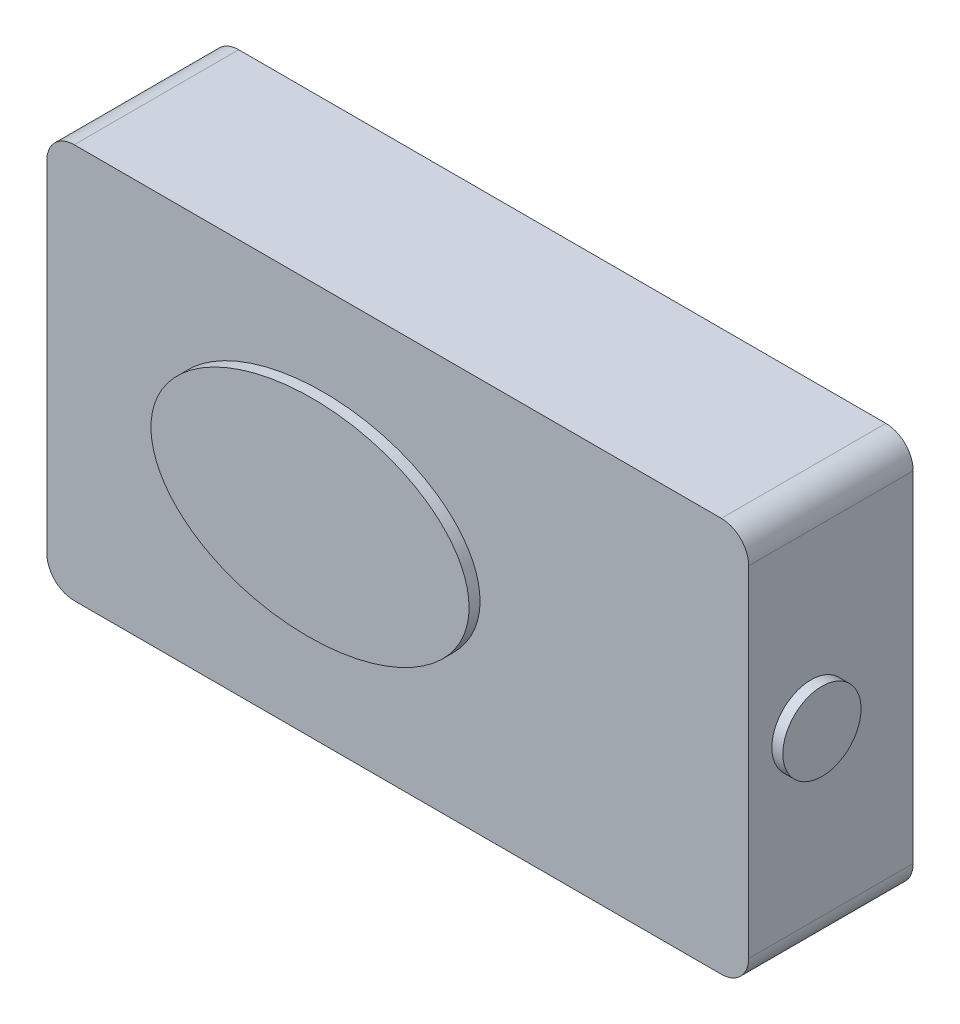
ISO-10303-21;
HEADER;
FILE_DESCRIPTION(('STEP AP214'),'2;1');
FILE_NAME('part.step','',(''),(''),'','','');
FILE_SCHEMA(('AUTOMOTIVE_DESIGN { 1 0 10303 214 1 1 1 1 }'));
ENDSEC;
DATA;
#1=APPLICATION_CONTEXT('core data for automotive mechanical design processes');
#2=APPLICATION_PROTOCOL_DEFINITION('international standard','automotive_design',2000,#1);
#3=PRODUCT_CONTEXT('',#1,'mechanical');
#4=PRODUCT('Part','Part','',(#3));
#5=PRODUCT_RELATED_PRODUCT_CATEGORY('part','',(#4));
#6=PRODUCT_DEFINITION_FORMATION('','',#4);
#7=PRODUCT_DEFINITION_CONTEXT('part definition',#1,'design');
#8=PRODUCT_DEFINITION('design','',#6,#7);
#9=PRODUCT_DEFINITION_SHAPE('','',#8);
#10=(LENGTH_UNIT() NAMED_UNIT(*) SI_UNIT(.MILLI.,.METRE.));
#11=(NAMED_UNIT(*) PLANE_ANGLE_UNIT() SI_UNIT($,.RADIAN.));
#12=(NAMED_UNIT(*) SI_UNIT($,.STERADIAN.) SOLID_ANGLE_UNIT());
#13=UNCERTAINTY_MEASURE_WITH_UNIT(LENGTH_MEASURE(1.E-05),#10,'distance_accuracy_value','');
#14=(GEOMETRIC_REPRESENTATION_CONTEXT(3) GLOBAL_UNCERTAINTY_ASSIGNED_CONTEXT((#13)) GLOBAL_UNIT_ASSIGNED_CONTEXT((#10,
#11,#12)) REPRESENTATION_CONTEXT('',''));
#15=CARTESIAN_POINT('',(0.,0.,0.));
#16=DIRECTION('',(0.,0.,1.));
#17=DIRECTION('',(1.,0.,0.));
#18=AXIS2_PLACEMENT_3D('',#15,#16,#17);
#19=CARTESIAN_POINT('',(34.3104693140794,17.9061371841155,15.));
#20=DIRECTION('',(-1.,0.,0.));
#21=DIRECTION('',(0.,0.,1.));
#22=AXIS2_PLACEMENT_3D('',#19,#20,#21);
#23=PLANE('',#22);
#24=DIRECTION('',(0.,1.,0.));
#25=VECTOR('',#24,1.);
#26=CARTESIAN_POINT('',(34.3104693140794,17.9061371841155,15.));
#27=LINE('',#26,#25);
#28=CARTESIAN_POINT('',(34.3104693140794,-15.5938628158845,15.));
#29=VERTEX_POINT('',#28);
#30=CARTESIAN_POINT('',(34.3104693140794,15.4061371841155,15.));
#31=VERTEX_POINT('',#30);
#32=EDGE_CURVE('E171',#29,#31,#27,.T.);
#33=ORIENTED_EDGE('',*,*,#32,.F.);
#34=DIRECTION('',(0.,0.,-1.));
#35=VECTOR('',#34,1.);
#36=CARTESIAN_POINT('',(34.3104693140794,-15.5938628158845,15.));
#37=LINE('',#36,#35);
#38=CARTESIAN_POINT('',(34.3104693140794,-15.5938628158845,0.));
#39=VERTEX_POINT('',#38);
#40=EDGE_CURVE('E155',#29,#39,#37,.T.);
#41=ORIENTED_EDGE('',*,*,#40,.T.);
#42=DIRECTION('',(0.,1.,0.));
#43=VECTOR('',#42,1.);
#44=CARTESIAN_POINT('',(34.3104693140794,17.9061371841155,0.));
#45=LINE('',#44,#43);
#46=CARTESIAN_POINT('',(34.3104693140794,15.4061371841155,0.));
#47=VERTEX_POINT('',#46);
#48=EDGE_CURVE('E125',#39,#47,#45,.T.);
#49=ORIENTED_EDGE('',*,*,#48,.T.);
#50=DIRECTION('',(0.,0.,-1.));
#51=VECTOR('',#50,1.);
#52=CARTESIAN_POINT('',(34.3104693140794,15.4061371841155,15.));
#53=LINE('',#52,#51);
#54=EDGE_CURVE('E153',#47,#31,#53,.F.);
#55=ORIENTED_EDGE('',*,*,#54,.T.);
#56=EDGE_LOOP('',(#33,#41,#49,#55));
#57=FACE_BOUND('',#56,.T.);
#58=CARTESIAN_POINT('',(34.3104693140794,0.,9.32507397833859));
#59=DIRECTION('',(-1.,0.,0.));
#60=DIRECTION('',(0.,0.,1.));
#61=AXIS2_PLACEMENT_3D('',#58,#59,#60);
#62=CIRCLE('',#61,3.56369619228473);
#63=CARTESIAN_POINT('',(34.3104693140794,0.,12.8887701706233));
#64=VERTEX_POINT('',#63);
#65=EDGE_CURVE('E11',#64,#64,#62,.F.);
#66=ORIENTED_EDGE('',*,*,#65,.F.);
#67=EDGE_LOOP('',(#66));
#68=FACE_BOUND('',#67,.T.);
#69=ADVANCED_FACE('F32',(#57,#68),#23,.F.);
#70=CARTESIAN_POINT('',(0.,0.,15.));
#71=DIRECTION('',(0.,0.,1.));
#72=DIRECTION('',(1.,0.,0.));
#73=AXIS2_PLACEMENT_3D('',#70,#71,#72);
#74=PLANE('',#73);
#75=DIRECTION('',(0.,-1.,0.));
#76=VECTOR('',#75,1.);
#77=CARTESIAN_POINT('',(-29.6895306859206,17.9061371841155,15.));
#78=LINE('',#77,#76);
#79=CARTESIAN_POINT('',(-29.6895306859206,15.4061371841155,15.));
#80=VERTEX_POINT('',#79);
#81=CARTESIAN_POINT('',(-29.6895306859206,-15.5938628158845,15.));
#82=VERTEX_POINT('',#81);
#83=EDGE_CURVE('E136',#80,#82,#78,.T.);
#84=ORIENTED_EDGE('',*,*,#83,.T.);
#85=CARTESIAN_POINT('',(-27.1895306859206,-15.5938628158845,15.));
#86=DIRECTION('',(0.,0.,1.));
#87=DIRECTION('',(1.,0.,0.));
#88=AXIS2_PLACEMENT_3D('',#85,#86,#87);
#89=CIRCLE('',#88,2.5);
#90=CARTESIAN_POINT('',(-27.1895306859206,-18.0938628158845,15.));
#91=VERTEX_POINT('',#90);
#92=EDGE_CURVE('E151',#82,#91,#89,.T.);
#93=ORIENTED_EDGE('',*,*,#92,.T.);
#94=DIRECTION('',(1.,0.,0.));
#95=VECTOR('',#94,1.);
#96=CARTESIAN_POINT('',(-29.6895306859206,-18.0938628158845,15.));
#97=LINE('',#96,#95);
#98=CARTESIAN_POINT('',(31.8104693140794,-18.0938628158845,15.));
#99=VERTEX_POINT('',#98);
#100=EDGE_CURVE('E119',#91,#99,#97,.T.);
#101=ORIENTED_EDGE('',*,*,#100,.T.);
#102=CARTESIAN_POINT('',(31.8104693140794,-15.5938628158845,15.));
#103=DIRECTION('',(0.,0.,1.));
#104=DIRECTION('',(1.,0.,0.));
#105=AXIS2_PLACEMENT_3D('',#102,#103,#104);
#106=CIRCLE('',#105,2.5);
#107=EDGE_CURVE('E149',#99,#29,#106,.T.);
#108=ORIENTED_EDGE('',*,*,#107,.T.);
#109=ORIENTED_EDGE('',*,*,#32,.T.);
#110=CARTESIAN_POINT('',(31.8104693140794,15.4061371841155,15.));
#111=DIRECTION('',(0.,0.,1.));
#112=DIRECTION('',(1.,0.,0.));
#113=AXIS2_PLACEMENT_3D('',#110,#111,#112);
#114=CIRCLE('',#113,2.5);
#115=CARTESIAN_POINT('',(31.8104693140794,17.9061371841155,15.));
#116=VERTEX_POINT('',#115);
#117=EDGE_CURVE('E54',#31,#116,#114,.T.);
#118=ORIENTED_EDGE('',*,*,#117,.T.);
#119=DIRECTION('',(-1.,0.,0.));
#120=VECTOR('',#119,1.);
#121=CARTESIAN_POINT('',(-29.6895306859206,17.9061371841155,15.));
#122=LINE('',#121,#120);
#123=CARTESIAN_POINT('',(-27.1895306859206,17.9061371841155,15.));
#124=VERTEX_POINT('',#123);
#125=EDGE_CURVE('E137',#116,#124,#122,.T.);
#126=ORIENTED_EDGE('',*,*,#125,.T.);
#127=CARTESIAN_POINT('',(-27.1895306859206,15.4061371841155,15.));
#128=DIRECTION('',(0.,0.,1.));
#129=DIRECTION('',(1.,0.,0.));
#130=AXIS2_PLACEMENT_3D('',#127,#128,#129);
#131=CIRCLE('',#130,2.5);
#132=EDGE_CURVE('E146',#124,#80,#131,.T.);
#133=ORIENTED_EDGE('',*,*,#132,.T.);
#134=EDGE_LOOP('',(#84,#93,#101,#108,#109,#118,#126,#133));
#135=FACE_BOUND('',#134,.T.);
#136=CARTESIAN_POINT('',(-4.68953068592058,0.237212402794285,15.));
#137=DIRECTION('',(0.,0.,1.));
#138=DIRECTION('',(0.999866210625792,0.0163572873307144,0.));
#139=AXIS2_PLACEMENT_3D('',#136,#137,#138);
#140=ELLIPSE('',#139,14.5019402055049,9.5);
#141=CARTESIAN_POINT('',(9.81046931407942,0.474424805588568,15.));
#142=VERTEX_POINT('',#141);
#143=EDGE_CURVE('E174',#142,#142,#140,.T.);
#144=ORIENTED_EDGE('',*,*,#143,.F.);
#145=EDGE_LOOP('',(#144));
#146=FACE_BOUND('',#145,.T.);
#147=ADVANCED_FACE('F177',(#135,#146),#74,.T.);
#148=CARTESIAN_POINT('',(-29.6895306859206,17.9061371841155,15.));
#149=DIRECTION('',(1.,0.,0.));
#150=DIRECTION('',(0.,1.,0.));
#151=AXIS2_PLACEMENT_3D('',#148,#149,#150);
#152=PLANE('',#151);
#153=DIRECTION('',(0.,-1.,0.));
#154=VECTOR('',#153,1.);
#155=CARTESIAN_POINT('',(-29.6895306859206,17.9061371841155,0.));
#156=LINE('',#155,#154);
#157=CARTESIAN_POINT('',(-29.6895306859206,15.4061371841155,0.));
#158=VERTEX_POINT('',#157);
#159=CARTESIAN_POINT('',(-29.6895306859206,-15.5938628158845,0.));
#160=VERTEX_POINT('',#159);
#161=EDGE_CURVE('E126',#158,#160,#156,.T.);
#162=ORIENTED_EDGE('',*,*,#161,.T.);
#163=DIRECTION('',(0.,0.,-1.));
#164=VECTOR('',#163,1.);
#165=CARTESIAN_POINT('',(-29.6895306859206,-15.5938628158845,15.));
#166=LINE('',#165,#164);
#167=EDGE_CURVE('E104',#160,#82,#166,.F.);
#168=ORIENTED_EDGE('',*,*,#167,.T.);
#169=ORIENTED_EDGE('',*,*,#83,.F.);
#170=DIRECTION('',(0.,0.,-1.));
#171=VECTOR('',#170,1.);
#172=CARTESIAN_POINT('',(-29.6895306859206,15.4061371841155,15.));
#173=LINE('',#172,#171);
#174=EDGE_CURVE('E109',#80,#158,#173,.T.);
#175=ORIENTED_EDGE('',*,*,#174,.T.);
#176=EDGE_LOOP('',(#162,#168,#169,#175));
#177=FACE_BOUND('',#176,.T.);
#178=ADVANCED_FACE('F168',(#177),#152,.F.);
#179=CARTESIAN_POINT('',(-29.6895306859206,-18.0938628158845,15.));
#180=DIRECTION('',(0.,1.,0.));
#181=DIRECTION('',(0.,0.,1.));
#182=AXIS2_PLACEMENT_3D('',#179,#180,#181);
#183=PLANE('',#182);
#184=ORIENTED_EDGE('',*,*,#100,.F.);
#185=DIRECTION('',(0.,0.,-1.));
#186=VECTOR('',#185,1.);
#187=CARTESIAN_POINT('',(-27.1895306859206,-18.0938628158845,15.));
#188=LINE('',#187,#186);
#189=CARTESIAN_POINT('',(-27.1895306859206,-18.0938628158845,0.));
#190=VERTEX_POINT('',#189);
#191=EDGE_CURVE('E103',#91,#190,#188,.T.);
#192=ORIENTED_EDGE('',*,*,#191,.T.);
#193=DIRECTION('',(1.,0.,0.));
#194=VECTOR('',#193,1.);
#195=CARTESIAN_POINT('',(-29.6895306859206,-18.0938628158845,0.));
#196=LINE('',#195,#194);
#197=CARTESIAN_POINT('',(31.8104693140794,-18.0938628158845,0.));
#198=VERTEX_POINT('',#197);
#199=EDGE_CURVE('E116',#190,#198,#196,.T.);
#200=ORIENTED_EDGE('',*,*,#199,.T.);
#201=DIRECTION('',(0.,0.,-1.));
#202=VECTOR('',#201,1.);
#203=CARTESIAN_POINT('',(31.8104693140794,-18.0938628158845,15.));
#204=LINE('',#203,#202);
#205=EDGE_CURVE('E121',#198,#99,#204,.F.);
#206=ORIENTED_EDGE('',*,*,#205,.T.);
#207=EDGE_LOOP('',(#184,#192,#200,#206));
#208=FACE_BOUND('',#207,.T.);
#209=ADVANCED_FACE('F115',(#208),#183,.F.);
#210=CARTESIAN_POINT('',(-29.6895306859206,17.9061371841155,15.));
#211=DIRECTION('',(0.,-1.,0.));
#212=DIRECTION('',(0.,0.,-1.));
#213=AXIS2_PLACEMENT_3D('',#210,#211,#212);
#214=PLANE('',#213);
#215=ORIENTED_EDGE('',*,*,#125,.F.);
#216=DIRECTION('',(0.,0.,-1.));
#217=VECTOR('',#216,1.);
#218=CARTESIAN_POINT('',(31.8104693140794,17.9061371841155,15.));
#219=LINE('',#218,#217);
#220=CARTESIAN_POINT('',(31.8104693140794,17.9061371841155,0.));
#221=VERTEX_POINT('',#220);
#222=EDGE_CURVE('E40',#116,#221,#219,.T.);
#223=ORIENTED_EDGE('',*,*,#222,.T.);
#224=DIRECTION('',(-1.,0.,0.));
#225=VECTOR('',#224,1.);
#226=CARTESIAN_POINT('',(-29.6895306859206,17.9061371841155,0.));
#227=LINE('',#226,#225);
#228=CARTESIAN_POINT('',(-27.1895306859206,17.9061371841155,0.));
#229=VERTEX_POINT('',#228);
#230=EDGE_CURVE('E129',#221,#229,#227,.T.);
#231=ORIENTED_EDGE('',*,*,#230,.T.);
#232=DIRECTION('',(0.,0.,-1.));
#233=VECTOR('',#232,1.);
#234=CARTESIAN_POINT('',(-27.1895306859206,17.9061371841155,15.));
#235=LINE('',#234,#233);
#236=EDGE_CURVE('E47',#229,#124,#235,.F.);
#237=ORIENTED_EDGE('',*,*,#236,.T.);
#238=EDGE_LOOP('',(#215,#223,#231,#237));
#239=FACE_BOUND('',#238,.T.);
#240=ADVANCED_FACE('F161',(#239),#214,.F.);
#241=CARTESIAN_POINT('',(0.,0.,0.));
#242=DIRECTION('',(0.,0.,1.));
#243=DIRECTION('',(1.,0.,0.));
#244=AXIS2_PLACEMENT_3D('',#241,#242,#243);
#245=PLANE('',#244);
#246=ORIENTED_EDGE('',*,*,#199,.F.);
#247=CARTESIAN_POINT('',(-27.1895306859206,-15.5938628158845,0.));
#248=DIRECTION('',(0.,0.,1.));
#249=DIRECTION('',(1.,0.,0.));
#250=AXIS2_PLACEMENT_3D('',#247,#248,#249);
#251=CIRCLE('',#250,2.5);
#252=EDGE_CURVE('E99',#190,#160,#251,.F.);
#253=ORIENTED_EDGE('',*,*,#252,.T.);
#254=ORIENTED_EDGE('',*,*,#161,.F.);
#255=CARTESIAN_POINT('',(-27.1895306859206,15.4061371841155,0.));
#256=DIRECTION('',(0.,0.,1.));
#257=DIRECTION('',(1.,0.,0.));
#258=AXIS2_PLACEMENT_3D('',#255,#256,#257);
#259=CIRCLE('',#258,2.5);
#260=EDGE_CURVE('E120',#158,#229,#259,.F.);
#261=ORIENTED_EDGE('',*,*,#260,.T.);
#262=ORIENTED_EDGE('',*,*,#230,.F.);
#263=CARTESIAN_POINT('',(31.8104693140794,15.4061371841155,0.));
#264=DIRECTION('',(0.,0.,1.));
#265=DIRECTION('',(1.,0.,0.));
#266=AXIS2_PLACEMENT_3D('',#263,#264,#265);
#267=CIRCLE('',#266,2.5);
#268=EDGE_CURVE('E140',#221,#47,#267,.F.);
#269=ORIENTED_EDGE('',*,*,#268,.T.);
#270=ORIENTED_EDGE('',*,*,#48,.F.);
#271=CARTESIAN_POINT('',(31.8104693140794,-15.5938628158845,0.));
#272=DIRECTION('',(0.,0.,1.));
#273=DIRECTION('',(1.,0.,0.));
#274=AXIS2_PLACEMENT_3D('',#271,#272,#273);
#275=CIRCLE('',#274,2.5);
#276=EDGE_CURVE('E110',#39,#198,#275,.F.);
#277=ORIENTED_EDGE('',*,*,#276,.T.);
#278=EDGE_LOOP('',(#246,#253,#254,#261,#262,#269,#270,#277));
#279=FACE_BOUND('',#278,.T.);
#280=ADVANCED_FACE('F123',(#279),#245,.F.);
#281=CARTESIAN_POINT('',(-27.1895306859206,-15.5938628158845,15.));
#282=DIRECTION('',(0.,0.,-1.));
#283=DIRECTION('',(-1.,0.,0.));
#284=AXIS2_PLACEMENT_3D('',#281,#282,#283);
#285=CYLINDRICAL_SURFACE('',#284,2.5);
#286=ORIENTED_EDGE('',*,*,#92,.F.);
#287=ORIENTED_EDGE('',*,*,#167,.F.);
#288=ORIENTED_EDGE('',*,*,#252,.F.);
#289=ORIENTED_EDGE('',*,*,#191,.F.);
#290=EDGE_LOOP('',(#286,#287,#288,#289));
#291=FACE_BOUND('',#290,.T.);
#292=ADVANCED_FACE('F102',(#291),#285,.T.);
#293=CARTESIAN_POINT('',(31.8104693140794,-15.5938628158845,15.));
#294=DIRECTION('',(0.,0.,-1.));
#295=DIRECTION('',(-1.,0.,0.));
#296=AXIS2_PLACEMENT_3D('',#293,#294,#295);
#297=CYLINDRICAL_SURFACE('',#296,2.5);
#298=ORIENTED_EDGE('',*,*,#107,.F.);
#299=ORIENTED_EDGE('',*,*,#205,.F.);
#300=ORIENTED_EDGE('',*,*,#276,.F.);
#301=ORIENTED_EDGE('',*,*,#40,.F.);
#302=EDGE_LOOP('',(#298,#299,#300,#301));
#303=FACE_BOUND('',#302,.T.);
#304=ADVANCED_FACE('F212',(#303),#297,.T.);
#305=CARTESIAN_POINT('',(31.8104693140794,15.4061371841155,15.));
#306=DIRECTION('',(0.,0.,-1.));
#307=DIRECTION('',(-1.,0.,0.));
#308=AXIS2_PLACEMENT_3D('',#305,#306,#307);
#309=CYLINDRICAL_SURFACE('',#308,2.5);
#310=ORIENTED_EDGE('',*,*,#117,.F.);
#311=ORIENTED_EDGE('',*,*,#54,.F.);
#312=ORIENTED_EDGE('',*,*,#268,.F.);
#313=ORIENTED_EDGE('',*,*,#222,.F.);
#314=EDGE_LOOP('',(#310,#311,#312,#313));
#315=FACE_BOUND('',#314,.T.);
#316=ADVANCED_FACE('F214',(#315),#309,.T.);
#317=CARTESIAN_POINT('',(-27.1895306859206,15.4061371841155,15.));
#318=DIRECTION('',(0.,0.,-1.));
#319=DIRECTION('',(-1.,0.,0.));
#320=AXIS2_PLACEMENT_3D('',#317,#318,#319);
#321=CYLINDRICAL_SURFACE('',#320,2.5);
#322=ORIENTED_EDGE('',*,*,#132,.F.);
#323=ORIENTED_EDGE('',*,*,#236,.F.);
#324=ORIENTED_EDGE('',*,*,#260,.F.);
#325=ORIENTED_EDGE('',*,*,#174,.F.);
#326=EDGE_LOOP('',(#322,#323,#324,#325));
#327=FACE_BOUND('',#326,.T.);
#328=ADVANCED_FACE('F34',(#327),#321,.T.);
#329=CARTESIAN_POINT('',(-4.68953068592058,0.237212402794285,16.));
#330=DIRECTION('',(0.,0.,1.));
#331=DIRECTION('',(0.999866210625792,0.0163572873307144,0.));
#332=AXIS2_PLACEMENT_3D('',#329,#330,#331);
#333=ELLIPSE('',#332,14.5019402055049,9.5);
#334=DIRECTION('',(0.,0.,-1.));
#335=VECTOR('',#334,1.);
#336=SURFACE_OF_LINEAR_EXTRUSION('',#333,#335);
#337=CARTESIAN_POINT('',(9.81046931407942,0.474424805588568,16.));
#338=VERTEX_POINT('',#337);
#339=EDGE_CURVE('E131',#338,#338,#333,.T.);
#340=ORIENTED_EDGE('',*,*,#339,.F.);
#341=EDGE_LOOP('',(#340));
#342=FACE_BOUND('',#341,.T.);
#343=ORIENTED_EDGE('',*,*,#143,.T.);
#344=EDGE_LOOP('',(#343));
#345=FACE_BOUND('',#344,.T.);
#346=ADVANCED_FACE('F192',(#342,#345),#336,.F.);
#347=CARTESIAN_POINT('',(-4.68953068592058,0.237212402794285,16.));
#348=DIRECTION('',(0.,0.,1.));
#349=DIRECTION('',(1.,0.,0.));
#350=AXIS2_PLACEMENT_3D('',#347,#348,#349);
#351=PLANE('',#350);
#352=ORIENTED_EDGE('',*,*,#339,.T.);
#353=EDGE_LOOP('',(#352));
#354=FACE_BOUND('',#353,.T.);
#355=ADVANCED_FACE('F195',(#354),#351,.T.);
#356=CARTESIAN_POINT('',(35.3104693140794,0.,9.32507397833859));
#357=DIRECTION('',(-1.,0.,0.));
#358=DIRECTION('',(0.,0.,1.));
#359=AXIS2_PLACEMENT_3D('',#356,#357,#358);
#360=CYLINDRICAL_SURFACE('',#359,3.56369619228473);
#361=CARTESIAN_POINT('',(35.3104693140794,0.,9.32507397833859));
#362=DIRECTION('',(1.,0.,0.));
#363=DIRECTION('',(0.,0.,-1.));
#364=AXIS2_PLACEMENT_3D('',#361,#362,#363);
#365=CIRCLE('',#364,3.56369619228473);
#366=CARTESIAN_POINT('',(35.3104693140794,0.,5.76137778605386));
#367=VERTEX_POINT('',#366);
#368=EDGE_CURVE('E184',#367,#367,#365,.T.);
#369=ORIENTED_EDGE('',*,*,#368,.F.);
#370=EDGE_LOOP('',(#369));
#371=FACE_BOUND('',#370,.T.);
#372=ORIENTED_EDGE('',*,*,#65,.T.);
#373=EDGE_LOOP('',(#372));
#374=FACE_BOUND('',#373,.T.);
#375=ADVANCED_FACE('F227',(#371,#374),#360,.T.);
#376=CARTESIAN_POINT('',(35.3104693140794,0.,9.32507397833859));
#377=DIRECTION('',(1.,0.,0.));
#378=DIRECTION('',(0.,0.,-1.));
#379=AXIS2_PLACEMENT_3D('',#376,#377,#378);
#380=PLANE('',#379);
#381=ORIENTED_EDGE('',*,*,#368,.T.);
#382=EDGE_LOOP('',(#381));
#383=FACE_BOUND('',#382,.T.);
#384=ADVANCED_FACE('F229',(#383),#380,.T.);
#385=CLOSED_SHELL('',(#69,#147,#178,#209,#240,#280,#292,#304,#316,#328,#346,#355,#375,#384));
#386=MANIFOLD_SOLID_BREP('B2',#385);
#387=ADVANCED_BREP_SHAPE_REPRESENTATION('',(#18,#386),#14);
#388=SHAPE_DEFINITION_REPRESENTATION(#9,#387);
ENDSEC;
END-ISO-10303-21;
